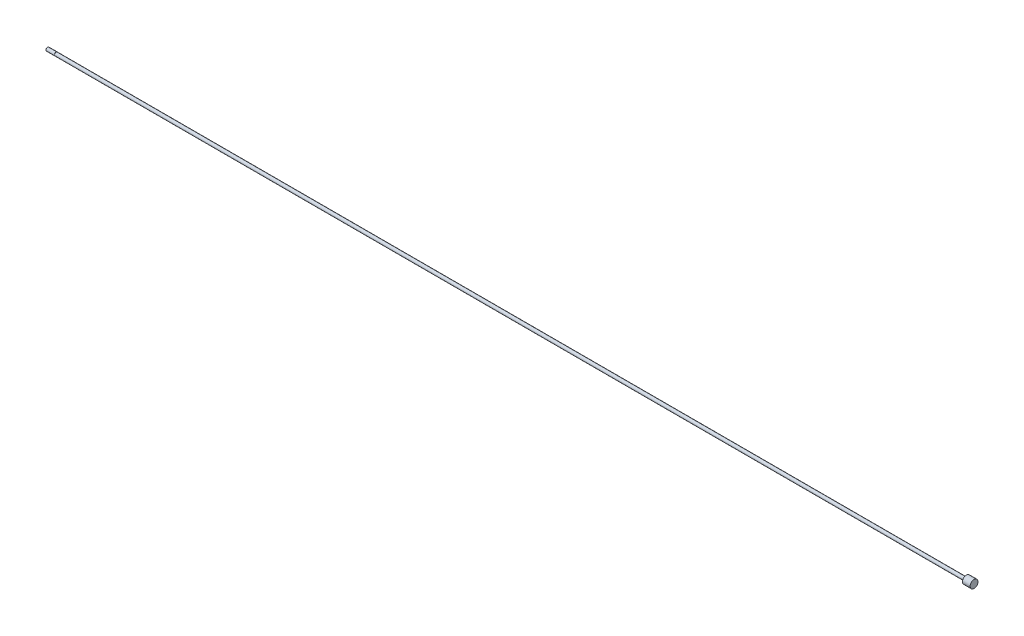
ISO-10303-21;
HEADER;
FILE_DESCRIPTION(('STEP AP214'),'2;1');
FILE_NAME('part.step','',(''),(''),'','','');
FILE_SCHEMA(('AUTOMOTIVE_DESIGN { 1 0 10303 214 1 1 1 1 }'));
ENDSEC;
DATA;
#1=APPLICATION_CONTEXT('core data for automotive mechanical design processes');
#2=APPLICATION_PROTOCOL_DEFINITION('international standard','automotive_design',2000,#1);
#3=PRODUCT_CONTEXT('',#1,'mechanical');
#4=PRODUCT('Part','Part','',(#3));
#5=PRODUCT_RELATED_PRODUCT_CATEGORY('part','',(#4));
#6=PRODUCT_DEFINITION_FORMATION('','',#4);
#7=PRODUCT_DEFINITION_CONTEXT('part definition',#1,'design');
#8=PRODUCT_DEFINITION('design','',#6,#7);
#9=PRODUCT_DEFINITION_SHAPE('','',#8);
#10=(LENGTH_UNIT() NAMED_UNIT(*) SI_UNIT(.MILLI.,.METRE.));
#11=(NAMED_UNIT(*) PLANE_ANGLE_UNIT() SI_UNIT($,.RADIAN.));
#12=(NAMED_UNIT(*) SI_UNIT($,.STERADIAN.) SOLID_ANGLE_UNIT());
#13=UNCERTAINTY_MEASURE_WITH_UNIT(LENGTH_MEASURE(1.E-05),#10,'distance_accuracy_value','');
#14=(GEOMETRIC_REPRESENTATION_CONTEXT(3) GLOBAL_UNCERTAINTY_ASSIGNED_CONTEXT((#13)) GLOBAL_UNIT_ASSIGNED_CONTEXT((#10,
#11,#12)) REPRESENTATION_CONTEXT('',''));
#15=CARTESIAN_POINT('',(0.,0.,0.));
#16=DIRECTION('',(0.,0.,1.));
#17=DIRECTION('',(1.,0.,0.));
#18=AXIS2_PLACEMENT_3D('',#15,#16,#17);
#19=CARTESIAN_POINT('',(1311.1988,0.,0.));
#20=DIRECTION('',(-1.,0.,0.));
#21=DIRECTION('',(0.,0.,1.));
#22=AXIS2_PLACEMENT_3D('',#19,#20,#21);
#23=CYLINDRICAL_SURFACE('',#22,2.3749);
#24=CARTESIAN_POINT('',(0.,0.,0.));
#25=DIRECTION('',(-1.,0.,0.));
#26=DIRECTION('',(0.,0.,1.));
#27=AXIS2_PLACEMENT_3D('',#24,#25,#26);
#28=CIRCLE('',#27,2.3749);
#29=CARTESIAN_POINT('',(0.,0.,2.3749));
#30=VERTEX_POINT('',#29);
#31=EDGE_CURVE('E56',#30,#30,#28,.T.);
#32=ORIENTED_EDGE('',*,*,#31,.F.);
#33=EDGE_LOOP('',(#32));
#34=FACE_BOUND('',#33,.T.);
#35=CARTESIAN_POINT('',(1300.1752,0.,0.));
#36=DIRECTION('',(-1.,0.,0.));
#37=DIRECTION('',(0.,0.,1.));
#38=AXIS2_PLACEMENT_3D('',#35,#36,#37);
#39=CIRCLE('',#38,2.3749);
#40=CARTESIAN_POINT('',(1300.1752,0.,2.3749));
#41=VERTEX_POINT('',#40);
#42=EDGE_CURVE('E10',#41,#41,#39,.T.);
#43=ORIENTED_EDGE('',*,*,#42,.T.);
#44=EDGE_LOOP('',(#43));
#45=FACE_BOUND('',#44,.T.);
#46=ADVANCED_FACE('F34',(#34,#45),#23,.T.);
#47=CARTESIAN_POINT('',(1300.1752,2.3749,0.));
#48=DIRECTION('',(1.,0.,0.));
#49=DIRECTION('',(0.,0.,-1.));
#50=AXIS2_PLACEMENT_3D('',#47,#48,#49);
#51=PLANE('',#50);
#52=ORIENTED_EDGE('',*,*,#42,.F.);
#53=EDGE_LOOP('',(#52));
#54=FACE_BOUND('',#53,.T.);
#55=CARTESIAN_POINT('',(1300.1752,0.,0.));
#56=DIRECTION('',(-1.,0.,0.));
#57=DIRECTION('',(0.,0.,1.));
#58=AXIS2_PLACEMENT_3D('',#55,#56,#57);
#59=CIRCLE('',#58,5.61975);
#60=CARTESIAN_POINT('',(1300.1752,0.,5.61975));
#61=VERTEX_POINT('',#60);
#62=EDGE_CURVE('E41',#61,#61,#59,.T.);
#63=ORIENTED_EDGE('',*,*,#62,.T.);
#64=EDGE_LOOP('',(#63));
#65=FACE_BOUND('',#64,.T.);
#66=ADVANCED_FACE('F77',(#54,#65),#51,.F.);
#67=CARTESIAN_POINT('',(1311.1988,0.,0.));
#68=DIRECTION('',(-1.,0.,0.));
#69=DIRECTION('',(0.,0.,1.));
#70=AXIS2_PLACEMENT_3D('',#67,#68,#69);
#71=CYLINDRICAL_SURFACE('',#70,5.61975);
#72=ORIENTED_EDGE('',*,*,#62,.F.);
#73=EDGE_LOOP('',(#72));
#74=FACE_BOUND('',#73,.T.);
#75=CARTESIAN_POINT('',(1311.1988,0.,0.));
#76=DIRECTION('',(-1.,0.,0.));
#77=DIRECTION('',(0.,0.,1.));
#78=AXIS2_PLACEMENT_3D('',#75,#76,#77);
#79=CIRCLE('',#78,5.61975);
#80=CARTESIAN_POINT('',(1311.1988,0.,5.61975));
#81=VERTEX_POINT('',#80);
#82=EDGE_CURVE('E45',#81,#81,#79,.T.);
#83=ORIENTED_EDGE('',*,*,#82,.T.);
#84=EDGE_LOOP('',(#83));
#85=FACE_BOUND('',#84,.T.);
#86=ADVANCED_FACE('F81',(#74,#85),#71,.T.);
#87=CARTESIAN_POINT('',(1311.1988,5.61975,0.));
#88=DIRECTION('',(-1.,0.,0.));
#89=DIRECTION('',(0.,0.,1.));
#90=AXIS2_PLACEMENT_3D('',#87,#88,#89);
#91=PLANE('',#90);
#92=ORIENTED_EDGE('',*,*,#82,.F.);
#93=EDGE_LOOP('',(#92));
#94=FACE_BOUND('',#93,.T.);
#95=ADVANCED_FACE('F86',(#94),#91,.F.);
#96=CARTESIAN_POINT('',(-0.254,2.667,0.));
#97=DIRECTION('',(1.,0.,0.));
#98=DIRECTION('',(0.,0.,-1.));
#99=AXIS2_PLACEMENT_3D('',#96,#97,#98);
#100=PLANE('',#99);
#101=CARTESIAN_POINT('',(-0.254,0.,0.));
#102=DIRECTION('',(-1.,0.,0.));
#103=DIRECTION('',(0.,0.,1.));
#104=AXIS2_PLACEMENT_3D('',#101,#102,#103);
#105=CIRCLE('',#104,2.159);
#106=CARTESIAN_POINT('',(-0.254,0.,2.159));
#107=VERTEX_POINT('',#106);
#108=EDGE_CURVE('E59',#107,#107,#105,.T.);
#109=ORIENTED_EDGE('',*,*,#108,.T.);
#110=EDGE_LOOP('',(#109));
#111=FACE_BOUND('',#110,.T.);
#112=CARTESIAN_POINT('',(-0.254,0.,0.));
#113=DIRECTION('',(1.,0.,0.));
#114=DIRECTION('',(0.,0.,-1.));
#115=AXIS2_PLACEMENT_3D('',#112,#113,#114);
#116=CIRCLE('',#115,2.413);
#117=CARTESIAN_POINT('',(-0.254,0.,-2.413));
#118=VERTEX_POINT('',#117);
#119=EDGE_CURVE('E37',#118,#118,#116,.T.);
#120=ORIENTED_EDGE('',*,*,#119,.T.);
#121=EDGE_LOOP('',(#120));
#122=FACE_BOUND('',#121,.T.);
#123=ADVANCED_FACE('F72',(#111,#122),#100,.T.);
#124=CARTESIAN_POINT('',(0.,2.159,0.));
#125=DIRECTION('',(-1.,0.,0.));
#126=DIRECTION('',(0.,0.,1.));
#127=AXIS2_PLACEMENT_3D('',#124,#125,#126);
#128=PLANE('',#127);
#129=CARTESIAN_POINT('',(0.,0.,0.));
#130=DIRECTION('',(-1.,0.,0.));
#131=DIRECTION('',(0.,0.,1.));
#132=AXIS2_PLACEMENT_3D('',#129,#130,#131);
#133=CIRCLE('',#132,2.159);
#134=CARTESIAN_POINT('',(0.,0.,2.159));
#135=VERTEX_POINT('',#134);
#136=EDGE_CURVE('E62',#135,#135,#133,.T.);
#137=ORIENTED_EDGE('',*,*,#136,.F.);
#138=EDGE_LOOP('',(#137));
#139=FACE_BOUND('',#138,.T.);
#140=ORIENTED_EDGE('',*,*,#31,.T.);
#141=EDGE_LOOP('',(#140));
#142=FACE_BOUND('',#141,.T.);
#143=ADVANCED_FACE('F69',(#139,#142),#128,.T.);
#144=CARTESIAN_POINT('',(0.,0.,0.));
#145=DIRECTION('',(-1.,0.,0.));
#146=DIRECTION('',(0.,0.,1.));
#147=AXIS2_PLACEMENT_3D('',#144,#145,#146);
#148=CYLINDRICAL_SURFACE('',#147,2.159);
#149=ORIENTED_EDGE('',*,*,#136,.T.);
#150=EDGE_LOOP('',(#149));
#151=FACE_BOUND('',#150,.T.);
#152=ORIENTED_EDGE('',*,*,#108,.F.);
#153=EDGE_LOOP('',(#152));
#154=FACE_BOUND('',#153,.T.);
#155=ADVANCED_FACE('F66',(#151,#154),#148,.T.);
#156=CARTESIAN_POINT('',(-12.7,0.,0.));
#157=DIRECTION('',(1.,0.,0.));
#158=DIRECTION('',(0.,0.,-1.));
#159=AXIS2_PLACEMENT_3D('',#156,#157,#158);
#160=PLANE('',#159);
#161=CARTESIAN_POINT('',(-12.7,0.,0.));
#162=DIRECTION('',(-1.,0.,0.));
#163=DIRECTION('',(0.,0.,1.));
#164=AXIS2_PLACEMENT_3D('',#161,#162,#163);
#165=CIRCLE('',#164,1.94056);
#166=CARTESIAN_POINT('',(-12.7,0.,1.94056));
#167=VERTEX_POINT('',#166);
#168=EDGE_CURVE('E50',#167,#167,#165,.T.);
#169=ORIENTED_EDGE('',*,*,#168,.T.);
#170=EDGE_LOOP('',(#169));
#171=FACE_BOUND('',#170,.T.);
#172=ADVANCED_FACE('F94',(#171),#160,.F.);
#173=CARTESIAN_POINT('',(-12.22756,0.,0.));
#174=DIRECTION('',(1.,0.,0.));
#175=DIRECTION('',(0.,0.,-1.));
#176=AXIS2_PLACEMENT_3D('',#173,#174,#175);
#177=CONICAL_SURFACE('',#176,2.413,0.785398163397449);
#178=ORIENTED_EDGE('',*,*,#168,.F.);
#179=EDGE_LOOP('',(#178));
#180=FACE_BOUND('',#179,.T.);
#181=CARTESIAN_POINT('',(-12.22756,0.,0.));
#182=DIRECTION('',(-1.,0.,0.));
#183=DIRECTION('',(0.,0.,1.));
#184=AXIS2_PLACEMENT_3D('',#181,#182,#183);
#185=CIRCLE('',#184,2.413);
#186=CARTESIAN_POINT('',(-12.22756,0.,2.413));
#187=VERTEX_POINT('',#186);
#188=EDGE_CURVE('E53',#187,#187,#185,.T.);
#189=ORIENTED_EDGE('',*,*,#188,.T.);
#190=EDGE_LOOP('',(#189));
#191=FACE_BOUND('',#190,.T.);
#192=ADVANCED_FACE('F97',(#180,#191),#177,.T.);
#193=CARTESIAN_POINT('',(0.,0.,0.));
#194=DIRECTION('',(-1.,0.,0.));
#195=DIRECTION('',(0.,0.,1.));
#196=AXIS2_PLACEMENT_3D('',#193,#194,#195);
#197=CYLINDRICAL_SURFACE('',#196,2.413);
#198=ORIENTED_EDGE('',*,*,#188,.F.);
#199=EDGE_LOOP('',(#198));
#200=FACE_BOUND('',#199,.T.);
#201=ORIENTED_EDGE('',*,*,#119,.F.);
#202=EDGE_LOOP('',(#201));
#203=FACE_BOUND('',#202,.T.);
#204=ADVANCED_FACE('F101',(#200,#203),#197,.T.);
#205=CLOSED_SHELL('',(#46,#66,#86,#95,#123,#143,#155,#172,#192,#204));
#206=MANIFOLD_SOLID_BREP('B2',#205);
#207=ADVANCED_BREP_SHAPE_REPRESENTATION('',(#18,#206),#14);
#208=SHAPE_DEFINITION_REPRESENTATION(#9,#207);
ENDSEC;
END-ISO-10303-21;
